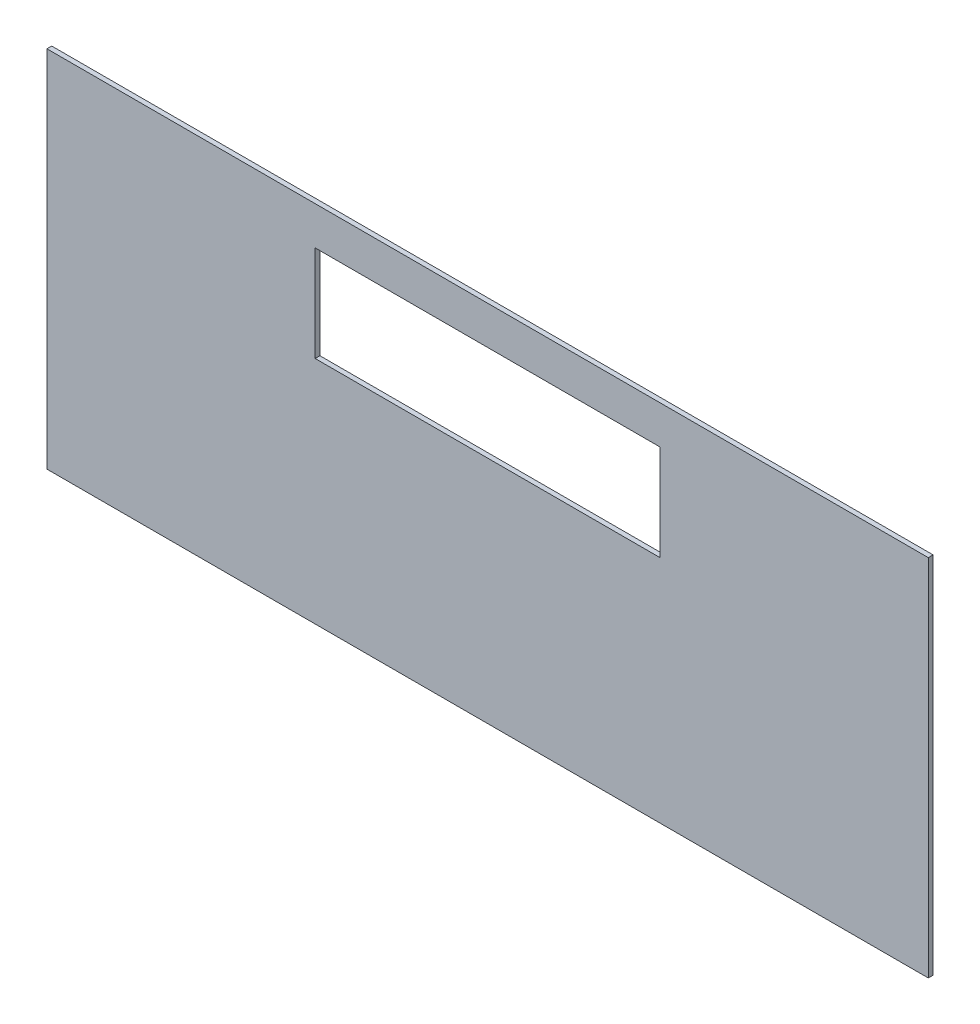
ISO-10303-21;
HEADER;
FILE_DESCRIPTION(('STEP AP214'),'2;1');
FILE_NAME('part.step','',(''),(''),'','','');
FILE_SCHEMA(('AUTOMOTIVE_DESIGN { 1 0 10303 214 1 1 1 1 }'));
ENDSEC;
DATA;
#1=APPLICATION_CONTEXT('core data for automotive mechanical design processes');
#2=APPLICATION_PROTOCOL_DEFINITION('international standard','automotive_design',2000,#1);
#3=PRODUCT_CONTEXT('',#1,'mechanical');
#4=PRODUCT('Part','Part','',(#3));
#5=PRODUCT_RELATED_PRODUCT_CATEGORY('part','',(#4));
#6=PRODUCT_DEFINITION_FORMATION('','',#4);
#7=PRODUCT_DEFINITION_CONTEXT('part definition',#1,'design');
#8=PRODUCT_DEFINITION('design','',#6,#7);
#9=PRODUCT_DEFINITION_SHAPE('','',#8);
#10=(LENGTH_UNIT() NAMED_UNIT(*) SI_UNIT(.MILLI.,.METRE.));
#11=(NAMED_UNIT(*) PLANE_ANGLE_UNIT() SI_UNIT($,.RADIAN.));
#12=(NAMED_UNIT(*) SI_UNIT($,.STERADIAN.) SOLID_ANGLE_UNIT());
#13=UNCERTAINTY_MEASURE_WITH_UNIT(LENGTH_MEASURE(1.E-05),#10,'distance_accuracy_value','');
#14=(GEOMETRIC_REPRESENTATION_CONTEXT(3) GLOBAL_UNCERTAINTY_ASSIGNED_CONTEXT((#13)) GLOBAL_UNIT_ASSIGNED_CONTEXT((#10,
#11,#12)) REPRESENTATION_CONTEXT('',''));
#15=CARTESIAN_POINT('',(0.,0.,0.));
#16=DIRECTION('',(0.,0.,1.));
#17=DIRECTION('',(1.,0.,0.));
#18=AXIS2_PLACEMENT_3D('',#15,#16,#17);
#19=CARTESIAN_POINT('',(0.,0.,0.));
#20=DIRECTION('',(0.,0.,1.));
#21=DIRECTION('',(1.,0.,0.));
#22=AXIS2_PLACEMENT_3D('',#19,#20,#21);
#23=PLANE('',#22);
#24=DIRECTION('',(1.,0.,0.));
#25=VECTOR('',#24,1.);
#26=CARTESIAN_POINT('',(-228.6,63.5,0.));
#27=LINE('',#26,#25);
#28=CARTESIAN_POINT('',(-228.6,63.5,0.));
#29=VERTEX_POINT('',#28);
#30=CARTESIAN_POINT('',(228.6,63.5,0.));
#31=VERTEX_POINT('',#30);
#32=EDGE_CURVE('E125',#29,#31,#27,.T.);
#33=ORIENTED_EDGE('',*,*,#32,.T.);
#34=DIRECTION('',(0.,1.,0.));
#35=VECTOR('',#34,1.);
#36=CARTESIAN_POINT('',(228.6,63.5,0.));
#37=LINE('',#36,#35);
#38=CARTESIAN_POINT('',(228.6,190.5,0.));
#39=VERTEX_POINT('',#38);
#40=EDGE_CURVE('E118',#31,#39,#37,.T.);
#41=ORIENTED_EDGE('',*,*,#40,.T.);
#42=DIRECTION('',(-1.,0.,0.));
#43=VECTOR('',#42,1.);
#44=CARTESIAN_POINT('',(228.6,190.5,0.));
#45=LINE('',#44,#43);
#46=CARTESIAN_POINT('',(-228.6,190.5,0.));
#47=VERTEX_POINT('',#46);
#48=EDGE_CURVE('E113',#39,#47,#45,.T.);
#49=ORIENTED_EDGE('',*,*,#48,.T.);
#50=DIRECTION('',(0.,-1.,0.));
#51=VECTOR('',#50,1.);
#52=CARTESIAN_POINT('',(-228.6,190.5,0.));
#53=LINE('',#52,#51);
#54=EDGE_CURVE('E109',#47,#29,#53,.T.);
#55=ORIENTED_EDGE('',*,*,#54,.T.);
#56=EDGE_LOOP('',(#33,#41,#49,#55));
#57=FACE_BOUND('',#56,.T.);
#58=DIRECTION('',(0.,1.,0.));
#59=VECTOR('',#58,1.);
#60=CARTESIAN_POINT('',(-584.2,241.3,0.));
#61=LINE('',#60,#59);
#62=CARTESIAN_POINT('',(-584.2,241.3,0.));
#63=VERTEX_POINT('',#62);
#64=CARTESIAN_POINT('',(-584.2,-241.3,0.));
#65=VERTEX_POINT('',#64);
#66=EDGE_CURVE('E103',#63,#65,#61,.F.);
#67=ORIENTED_EDGE('',*,*,#66,.F.);
#68=DIRECTION('',(1.,0.,0.));
#69=VECTOR('',#68,1.);
#70=CARTESIAN_POINT('',(584.2,241.3,0.));
#71=LINE('',#70,#69);
#72=CARTESIAN_POINT('',(584.2,241.3,0.));
#73=VERTEX_POINT('',#72);
#74=EDGE_CURVE('E79',#73,#63,#71,.F.);
#75=ORIENTED_EDGE('',*,*,#74,.F.);
#76=DIRECTION('',(0.,1.,0.));
#77=VECTOR('',#76,1.);
#78=CARTESIAN_POINT('',(584.2,-241.3,0.));
#79=LINE('',#78,#77);
#80=CARTESIAN_POINT('',(584.2,-241.3,0.));
#81=VERTEX_POINT('',#80);
#82=EDGE_CURVE('E81',#81,#73,#79,.T.);
#83=ORIENTED_EDGE('',*,*,#82,.F.);
#84=DIRECTION('',(1.,0.,0.));
#85=VECTOR('',#84,1.);
#86=CARTESIAN_POINT('',(-584.2,-241.3,0.));
#87=LINE('',#86,#85);
#88=EDGE_CURVE('E20',#65,#81,#87,.T.);
#89=ORIENTED_EDGE('',*,*,#88,.F.);
#90=EDGE_LOOP('',(#67,#75,#83,#89));
#91=FACE_BOUND('',#90,.T.);
#92=ADVANCED_FACE('F17',(#57,#91),#23,.F.);
#93=CARTESIAN_POINT('',(-584.2,-241.3,0.));
#94=DIRECTION('',(0.,-1.,0.));
#95=DIRECTION('',(0.,0.,-1.));
#96=AXIS2_PLACEMENT_3D('',#93,#94,#95);
#97=PLANE('',#96);
#98=DIRECTION('',(1.,0.,0.));
#99=VECTOR('',#98,1.);
#100=CARTESIAN_POINT('',(0.,-241.3,6.35));
#101=LINE('',#100,#99);
#102=CARTESIAN_POINT('',(-584.2,-241.3,6.35));
#103=VERTEX_POINT('',#102);
#104=CARTESIAN_POINT('',(584.2,-241.3,6.35));
#105=VERTEX_POINT('',#104);
#106=EDGE_CURVE('E128',#103,#105,#101,.T.);
#107=ORIENTED_EDGE('',*,*,#106,.F.);
#108=DIRECTION('',(0.,0.,1.));
#109=VECTOR('',#108,1.);
#110=CARTESIAN_POINT('',(-584.2,-241.3,0.));
#111=LINE('',#110,#109);
#112=EDGE_CURVE('E92',#65,#103,#111,.T.);
#113=ORIENTED_EDGE('',*,*,#112,.F.);
#114=ORIENTED_EDGE('',*,*,#88,.T.);
#115=DIRECTION('',(0.,0.,-1.));
#116=VECTOR('',#115,1.);
#117=CARTESIAN_POINT('',(584.2,-241.3,0.));
#118=LINE('',#117,#116);
#119=EDGE_CURVE('E87',#105,#81,#118,.T.);
#120=ORIENTED_EDGE('',*,*,#119,.F.);
#121=EDGE_LOOP('',(#107,#113,#114,#120));
#122=FACE_BOUND('',#121,.T.);
#123=ADVANCED_FACE('F89',(#122),#97,.T.);
#124=CARTESIAN_POINT('',(584.2,-241.3,0.));
#125=DIRECTION('',(1.,0.,0.));
#126=DIRECTION('',(0.,0.,-1.));
#127=AXIS2_PLACEMENT_3D('',#124,#125,#126);
#128=PLANE('',#127);
#129=DIRECTION('',(0.,1.,0.));
#130=VECTOR('',#129,1.);
#131=CARTESIAN_POINT('',(584.2,0.,6.35));
#132=LINE('',#131,#130);
#133=CARTESIAN_POINT('',(584.2,241.3,6.35));
#134=VERTEX_POINT('',#133);
#135=EDGE_CURVE('E96',#105,#134,#132,.T.);
#136=ORIENTED_EDGE('',*,*,#135,.F.);
#137=ORIENTED_EDGE('',*,*,#119,.T.);
#138=ORIENTED_EDGE('',*,*,#82,.T.);
#139=DIRECTION('',(0.,0.,1.));
#140=VECTOR('',#139,1.);
#141=CARTESIAN_POINT('',(584.2,241.3,0.));
#142=LINE('',#141,#140);
#143=EDGE_CURVE('E99',#134,#73,#142,.F.);
#144=ORIENTED_EDGE('',*,*,#143,.F.);
#145=EDGE_LOOP('',(#136,#137,#138,#144));
#146=FACE_BOUND('',#145,.T.);
#147=ADVANCED_FACE('F94',(#146),#128,.T.);
#148=CARTESIAN_POINT('',(584.2,241.3,0.));
#149=DIRECTION('',(0.,1.,0.));
#150=DIRECTION('',(0.,0.,1.));
#151=AXIS2_PLACEMENT_3D('',#148,#149,#150);
#152=PLANE('',#151);
#153=DIRECTION('',(1.,0.,0.));
#154=VECTOR('',#153,1.);
#155=CARTESIAN_POINT('',(0.,241.3,6.35));
#156=LINE('',#155,#154);
#157=CARTESIAN_POINT('',(-584.2,241.3,6.35));
#158=VERTEX_POINT('',#157);
#159=EDGE_CURVE('E131',#134,#158,#156,.F.);
#160=ORIENTED_EDGE('',*,*,#159,.F.);
#161=ORIENTED_EDGE('',*,*,#143,.T.);
#162=ORIENTED_EDGE('',*,*,#74,.T.);
#163=DIRECTION('',(0.,0.,1.));
#164=VECTOR('',#163,1.);
#165=CARTESIAN_POINT('',(-584.2,241.3,0.));
#166=LINE('',#165,#164);
#167=EDGE_CURVE('E106',#158,#63,#166,.F.);
#168=ORIENTED_EDGE('',*,*,#167,.F.);
#169=EDGE_LOOP('',(#160,#161,#162,#168));
#170=FACE_BOUND('',#169,.T.);
#171=ADVANCED_FACE('F169',(#170),#152,.T.);
#172=CARTESIAN_POINT('',(-584.2,241.3,0.));
#173=DIRECTION('',(-1.,0.,0.));
#174=DIRECTION('',(0.,0.,1.));
#175=AXIS2_PLACEMENT_3D('',#172,#173,#174);
#176=PLANE('',#175);
#177=DIRECTION('',(0.,1.,0.));
#178=VECTOR('',#177,1.);
#179=CARTESIAN_POINT('',(-584.2,0.,6.35));
#180=LINE('',#179,#178);
#181=EDGE_CURVE('E134',#158,#103,#180,.F.);
#182=ORIENTED_EDGE('',*,*,#181,.F.);
#183=ORIENTED_EDGE('',*,*,#167,.T.);
#184=ORIENTED_EDGE('',*,*,#66,.T.);
#185=ORIENTED_EDGE('',*,*,#112,.T.);
#186=EDGE_LOOP('',(#182,#183,#184,#185));
#187=FACE_BOUND('',#186,.T.);
#188=ADVANCED_FACE('F161',(#187),#176,.T.);
#189=CARTESIAN_POINT('',(-228.6,190.5,0.));
#190=DIRECTION('',(-1.,0.,0.));
#191=DIRECTION('',(0.,-1.,0.));
#192=AXIS2_PLACEMENT_3D('',#189,#190,#191);
#193=PLANE('',#192);
#194=DIRECTION('',(0.,0.,1.));
#195=VECTOR('',#194,1.);
#196=CARTESIAN_POINT('',(-228.6,190.5,0.));
#197=LINE('',#196,#195);
#198=CARTESIAN_POINT('',(-228.6,190.5,6.35));
#199=VERTEX_POINT('',#198);
#200=EDGE_CURVE('E111',#47,#199,#197,.T.);
#201=ORIENTED_EDGE('',*,*,#200,.T.);
#202=DIRECTION('',(0.,1.,0.));
#203=VECTOR('',#202,1.);
#204=CARTESIAN_POINT('',(-228.6,0.,6.35));
#205=LINE('',#204,#203);
#206=CARTESIAN_POINT('',(-228.6,63.5,6.35));
#207=VERTEX_POINT('',#206);
#208=EDGE_CURVE('E137',#207,#199,#205,.T.);
#209=ORIENTED_EDGE('',*,*,#208,.F.);
#210=DIRECTION('',(0.,0.,-1.));
#211=VECTOR('',#210,1.);
#212=CARTESIAN_POINT('',(-228.6,63.5,0.));
#213=LINE('',#212,#211);
#214=EDGE_CURVE('E122',#207,#29,#213,.T.);
#215=ORIENTED_EDGE('',*,*,#214,.T.);
#216=ORIENTED_EDGE('',*,*,#54,.F.);
#217=EDGE_LOOP('',(#201,#209,#215,#216));
#218=FACE_BOUND('',#217,.T.);
#219=ADVANCED_FACE('F159',(#218),#193,.F.);
#220=CARTESIAN_POINT('',(228.6,190.5,0.));
#221=DIRECTION('',(0.,1.,0.));
#222=DIRECTION('',(-1.,0.,0.));
#223=AXIS2_PLACEMENT_3D('',#220,#221,#222);
#224=PLANE('',#223);
#225=DIRECTION('',(0.,0.,1.));
#226=VECTOR('',#225,1.);
#227=CARTESIAN_POINT('',(228.6,190.5,0.));
#228=LINE('',#227,#226);
#229=CARTESIAN_POINT('',(228.6,190.5,6.35));
#230=VERTEX_POINT('',#229);
#231=EDGE_CURVE('E116',#39,#230,#228,.T.);
#232=ORIENTED_EDGE('',*,*,#231,.T.);
#233=DIRECTION('',(1.,0.,0.));
#234=VECTOR('',#233,1.);
#235=CARTESIAN_POINT('',(0.,190.5,6.35));
#236=LINE('',#235,#234);
#237=EDGE_CURVE('E140',#199,#230,#236,.T.);
#238=ORIENTED_EDGE('',*,*,#237,.F.);
#239=ORIENTED_EDGE('',*,*,#200,.F.);
#240=ORIENTED_EDGE('',*,*,#48,.F.);
#241=EDGE_LOOP('',(#232,#238,#239,#240));
#242=FACE_BOUND('',#241,.T.);
#243=ADVANCED_FACE('F151',(#242),#224,.F.);
#244=CARTESIAN_POINT('',(228.6,63.5,0.));
#245=DIRECTION('',(1.,0.,0.));
#246=DIRECTION('',(0.,1.,0.));
#247=AXIS2_PLACEMENT_3D('',#244,#245,#246);
#248=PLANE('',#247);
#249=DIRECTION('',(0.,0.,-1.));
#250=VECTOR('',#249,1.);
#251=CARTESIAN_POINT('',(228.6,63.5,0.));
#252=LINE('',#251,#250);
#253=CARTESIAN_POINT('',(228.6,63.5,6.35));
#254=VERTEX_POINT('',#253);
#255=EDGE_CURVE('E35',#31,#254,#252,.F.);
#256=ORIENTED_EDGE('',*,*,#255,.T.);
#257=DIRECTION('',(0.,1.,0.));
#258=VECTOR('',#257,1.);
#259=CARTESIAN_POINT('',(228.6,0.,6.35));
#260=LINE('',#259,#258);
#261=EDGE_CURVE('E26',#230,#254,#260,.F.);
#262=ORIENTED_EDGE('',*,*,#261,.F.);
#263=ORIENTED_EDGE('',*,*,#231,.F.);
#264=ORIENTED_EDGE('',*,*,#40,.F.);
#265=EDGE_LOOP('',(#256,#262,#263,#264));
#266=FACE_BOUND('',#265,.T.);
#267=ADVANCED_FACE('F149',(#266),#248,.F.);
#268=CARTESIAN_POINT('',(-228.6,63.5,0.));
#269=DIRECTION('',(0.,-1.,0.));
#270=DIRECTION('',(0.,0.,-1.));
#271=AXIS2_PLACEMENT_3D('',#268,#269,#270);
#272=PLANE('',#271);
#273=ORIENTED_EDGE('',*,*,#214,.F.);
#274=DIRECTION('',(1.,0.,0.));
#275=VECTOR('',#274,1.);
#276=CARTESIAN_POINT('',(0.,63.5,6.35));
#277=LINE('',#276,#275);
#278=EDGE_CURVE('E11',#254,#207,#277,.F.);
#279=ORIENTED_EDGE('',*,*,#278,.F.);
#280=ORIENTED_EDGE('',*,*,#255,.F.);
#281=ORIENTED_EDGE('',*,*,#32,.F.);
#282=EDGE_LOOP('',(#273,#279,#280,#281));
#283=FACE_BOUND('',#282,.T.);
#284=ADVANCED_FACE('F157',(#283),#272,.F.);
#285=CARTESIAN_POINT('',(0.,0.,6.35));
#286=DIRECTION('',(0.,0.,1.));
#287=DIRECTION('',(1.,0.,0.));
#288=AXIS2_PLACEMENT_3D('',#285,#286,#287);
#289=PLANE('',#288);
#290=ORIENTED_EDGE('',*,*,#261,.T.);
#291=ORIENTED_EDGE('',*,*,#278,.T.);
#292=ORIENTED_EDGE('',*,*,#208,.T.);
#293=ORIENTED_EDGE('',*,*,#237,.T.);
#294=EDGE_LOOP('',(#290,#291,#292,#293));
#295=FACE_BOUND('',#294,.T.);
#296=ORIENTED_EDGE('',*,*,#159,.T.);
#297=ORIENTED_EDGE('',*,*,#181,.T.);
#298=ORIENTED_EDGE('',*,*,#106,.T.);
#299=ORIENTED_EDGE('',*,*,#135,.T.);
#300=EDGE_LOOP('',(#296,#297,#298,#299));
#301=FACE_BOUND('',#300,.T.);
#302=ADVANCED_FACE('F145',(#295,#301),#289,.T.);
#303=CLOSED_SHELL('',(#92,#123,#147,#171,#188,#219,#243,#267,#284,#302));
#304=MANIFOLD_SOLID_BREP('B1',#303);
#305=ADVANCED_BREP_SHAPE_REPRESENTATION('',(#18,#304),#14);
#306=SHAPE_DEFINITION_REPRESENTATION(#9,#305);
ENDSEC;
END-ISO-10303-21;
